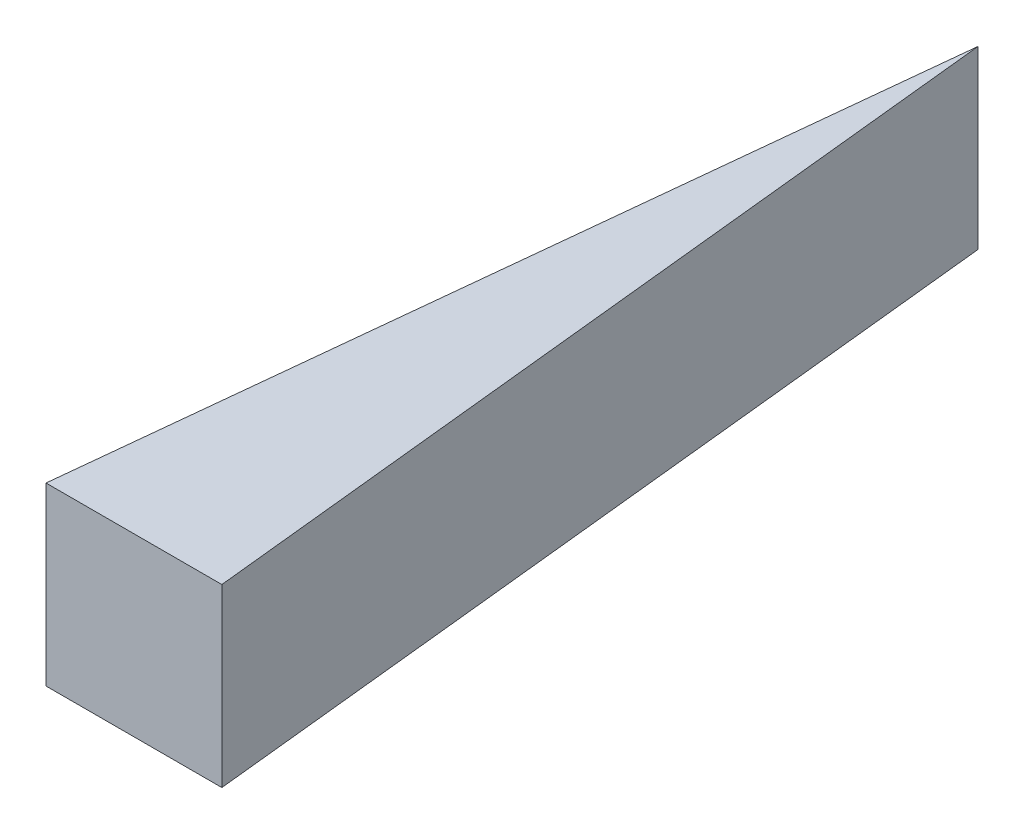
ISO-10303-21;
HEADER;
FILE_DESCRIPTION(('STEP AP214'),'2;1');
FILE_NAME('part.step','',(''),(''),'','','');
FILE_SCHEMA(('AUTOMOTIVE_DESIGN { 1 0 10303 214 1 1 1 1 }'));
ENDSEC;
DATA;
#1=APPLICATION_CONTEXT('core data for automotive mechanical design processes');
#2=APPLICATION_PROTOCOL_DEFINITION('international standard','automotive_design',2000,#1);
#3=PRODUCT_CONTEXT('',#1,'mechanical');
#4=PRODUCT('Part','Part','',(#3));
#5=PRODUCT_RELATED_PRODUCT_CATEGORY('part','',(#4));
#6=PRODUCT_DEFINITION_FORMATION('','',#4);
#7=PRODUCT_DEFINITION_CONTEXT('part definition',#1,'design');
#8=PRODUCT_DEFINITION('design','',#6,#7);
#9=PRODUCT_DEFINITION_SHAPE('','',#8);
#10=(LENGTH_UNIT() NAMED_UNIT(*) SI_UNIT(.MILLI.,.METRE.));
#11=(NAMED_UNIT(*) PLANE_ANGLE_UNIT() SI_UNIT($,.RADIAN.));
#12=(NAMED_UNIT(*) SI_UNIT($,.STERADIAN.) SOLID_ANGLE_UNIT());
#13=UNCERTAINTY_MEASURE_WITH_UNIT(LENGTH_MEASURE(1.E-05),#10,'distance_accuracy_value','');
#14=(GEOMETRIC_REPRESENTATION_CONTEXT(3) GLOBAL_UNCERTAINTY_ASSIGNED_CONTEXT((#13)) GLOBAL_UNIT_ASSIGNED_CONTEXT((#10,
#11,#12)) REPRESENTATION_CONTEXT('',''));
#15=CARTESIAN_POINT('',(0.,0.,0.));
#16=DIRECTION('',(0.,0.,1.));
#17=DIRECTION('',(1.,0.,0.));
#18=AXIS2_PLACEMENT_3D('',#15,#16,#17);
#19=CARTESIAN_POINT('',(2.5,5.,0.));
#20=DIRECTION('',(-0.994618408890778,0.,0.103606084259456));
#21=DIRECTION('',(0.103606084259456,0.,0.994618408890778));
#22=AXIS2_PLACEMENT_3D('',#19,#20,#21);
#23=PLANE('',#22);
#24=DIRECTION('',(-0.103606084259456,0.,-0.994618408890778));
#25=VECTOR('',#24,1.);
#26=CARTESIAN_POINT('',(2.5,0.,0.));
#27=LINE('',#26,#25);
#28=CARTESIAN_POINT('',(2.5,0.,0.));
#29=VERTEX_POINT('',#28);
#30=CARTESIAN_POINT('',(0.,0.,-24.));
#31=VERTEX_POINT('',#30);
#32=EDGE_CURVE('E80',#29,#31,#27,.T.);
#33=ORIENTED_EDGE('',*,*,#32,.T.);
#34=DIRECTION('',(0.,-1.,0.));
#35=VECTOR('',#34,1.);
#36=CARTESIAN_POINT('',(0.,5.,-24.));
#37=LINE('',#36,#35);
#38=CARTESIAN_POINT('',(0.,5.,-24.));
#39=VERTEX_POINT('',#38);
#40=EDGE_CURVE('E11',#39,#31,#37,.T.);
#41=ORIENTED_EDGE('',*,*,#40,.F.);
#42=DIRECTION('',(-0.103606084259456,0.,-0.994618408890778));
#43=VECTOR('',#42,1.);
#44=CARTESIAN_POINT('',(2.5,5.,0.));
#45=LINE('',#44,#43);
#46=CARTESIAN_POINT('',(2.5,5.,0.));
#47=VERTEX_POINT('',#46);
#48=EDGE_CURVE('E73',#47,#39,#45,.T.);
#49=ORIENTED_EDGE('',*,*,#48,.F.);
#50=DIRECTION('',(0.,-1.,0.));
#51=VECTOR('',#50,1.);
#52=CARTESIAN_POINT('',(2.5,5.,0.));
#53=LINE('',#52,#51);
#54=EDGE_CURVE('E81',#47,#29,#53,.T.);
#55=ORIENTED_EDGE('',*,*,#54,.T.);
#56=EDGE_LOOP('',(#33,#41,#49,#55));
#57=FACE_BOUND('',#56,.T.);
#58=ADVANCED_FACE('F33',(#57),#23,.F.);
#59=CARTESIAN_POINT('',(0.,5.,-24.));
#60=DIRECTION('',(0.994618408890778,0.,0.103606084259456));
#61=DIRECTION('',(0.103606084259456,0.,-0.994618408890778));
#62=AXIS2_PLACEMENT_3D('',#59,#60,#61);
#63=PLANE('',#62);
#64=DIRECTION('',(-0.103606084259456,0.,0.994618408890778));
#65=VECTOR('',#64,1.);
#66=CARTESIAN_POINT('',(0.,0.,-24.));
#67=LINE('',#66,#65);
#68=CARTESIAN_POINT('',(-2.5,0.,0.));
#69=VERTEX_POINT('',#68);
#70=EDGE_CURVE('E61',#31,#69,#67,.T.);
#71=ORIENTED_EDGE('',*,*,#70,.T.);
#72=DIRECTION('',(0.,-1.,0.));
#73=VECTOR('',#72,1.);
#74=CARTESIAN_POINT('',(-2.5,5.,0.));
#75=LINE('',#74,#73);
#76=CARTESIAN_POINT('',(-2.5,5.,0.));
#77=VERTEX_POINT('',#76);
#78=EDGE_CURVE('E41',#77,#69,#75,.T.);
#79=ORIENTED_EDGE('',*,*,#78,.F.);
#80=DIRECTION('',(-0.103606084259456,0.,0.994618408890778));
#81=VECTOR('',#80,1.);
#82=CARTESIAN_POINT('',(0.,5.,-24.));
#83=LINE('',#82,#81);
#84=EDGE_CURVE('E69',#39,#77,#83,.T.);
#85=ORIENTED_EDGE('',*,*,#84,.F.);
#86=ORIENTED_EDGE('',*,*,#40,.T.);
#87=EDGE_LOOP('',(#71,#79,#85,#86));
#88=FACE_BOUND('',#87,.T.);
#89=ADVANCED_FACE('F70',(#88),#63,.F.);
#90=CARTESIAN_POINT('',(-2.5,5.,0.));
#91=DIRECTION('',(0.,0.,-1.));
#92=DIRECTION('',(-1.,0.,0.));
#93=AXIS2_PLACEMENT_3D('',#90,#91,#92);
#94=PLANE('',#93);
#95=DIRECTION('',(1.,0.,0.));
#96=VECTOR('',#95,1.);
#97=CARTESIAN_POINT('',(-2.5,0.,0.));
#98=LINE('',#97,#96);
#99=EDGE_CURVE('E66',#69,#29,#98,.T.);
#100=ORIENTED_EDGE('',*,*,#99,.T.);
#101=ORIENTED_EDGE('',*,*,#54,.F.);
#102=DIRECTION('',(1.,0.,0.));
#103=VECTOR('',#102,1.);
#104=CARTESIAN_POINT('',(-2.5,5.,0.));
#105=LINE('',#104,#103);
#106=EDGE_CURVE('E49',#77,#47,#105,.T.);
#107=ORIENTED_EDGE('',*,*,#106,.F.);
#108=ORIENTED_EDGE('',*,*,#78,.T.);
#109=EDGE_LOOP('',(#100,#101,#107,#108));
#110=FACE_BOUND('',#109,.T.);
#111=ADVANCED_FACE('F88',(#110),#94,.F.);
#112=CARTESIAN_POINT('',(0.,5.,0.));
#113=DIRECTION('',(0.,-1.,0.));
#114=DIRECTION('',(0.,0.,-1.));
#115=AXIS2_PLACEMENT_3D('',#112,#113,#114);
#116=PLANE('',#115);
#117=ORIENTED_EDGE('',*,*,#48,.T.);
#118=ORIENTED_EDGE('',*,*,#84,.T.);
#119=ORIENTED_EDGE('',*,*,#106,.T.);
#120=EDGE_LOOP('',(#117,#118,#119));
#121=FACE_BOUND('',#120,.T.);
#122=ADVANCED_FACE('F76',(#121),#116,.F.);
#123=CARTESIAN_POINT('',(0.,0.,0.));
#124=DIRECTION('',(0.,-1.,0.));
#125=DIRECTION('',(0.,0.,-1.));
#126=AXIS2_PLACEMENT_3D('',#123,#124,#125);
#127=PLANE('',#126);
#128=ORIENTED_EDGE('',*,*,#32,.F.);
#129=ORIENTED_EDGE('',*,*,#99,.F.);
#130=ORIENTED_EDGE('',*,*,#70,.F.);
#131=EDGE_LOOP('',(#128,#129,#130));
#132=FACE_BOUND('',#131,.T.);
#133=ADVANCED_FACE('F89',(#132),#127,.T.);
#134=CLOSED_SHELL('',(#58,#89,#111,#122,#133));
#135=MANIFOLD_SOLID_BREP('B2',#134);
#136=ADVANCED_BREP_SHAPE_REPRESENTATION('',(#18,#135),#14);
#137=SHAPE_DEFINITION_REPRESENTATION(#9,#136);
ENDSEC;
END-ISO-10303-21;
